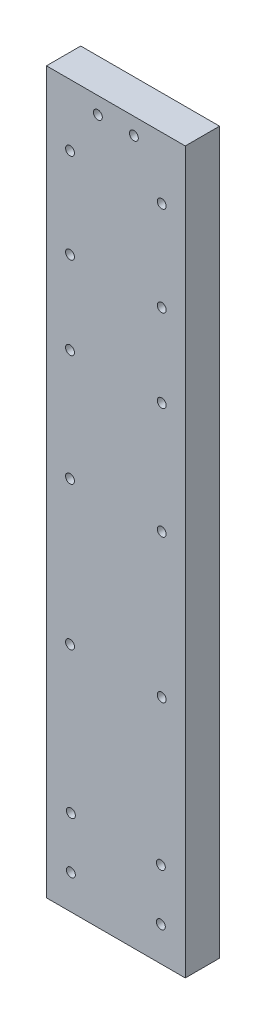
ISO-10303-21;
HEADER;
FILE_DESCRIPTION(('STEP AP214'),'2;1');
FILE_NAME('part.step','',(''),(''),'','','');
FILE_SCHEMA(('AUTOMOTIVE_DESIGN { 1 0 10303 214 1 1 1 1 }'));
ENDSEC;
DATA;
#1=APPLICATION_CONTEXT('core data for automotive mechanical design processes');
#2=APPLICATION_PROTOCOL_DEFINITION('international standard','automotive_design',2000,#1);
#3=PRODUCT_CONTEXT('',#1,'mechanical');
#4=PRODUCT('Part','Part','',(#3));
#5=PRODUCT_RELATED_PRODUCT_CATEGORY('part','',(#4));
#6=PRODUCT_DEFINITION_FORMATION('','',#4);
#7=PRODUCT_DEFINITION_CONTEXT('part definition',#1,'design');
#8=PRODUCT_DEFINITION('design','',#6,#7);
#9=PRODUCT_DEFINITION_SHAPE('','',#8);
#10=(LENGTH_UNIT() NAMED_UNIT(*) SI_UNIT(.MILLI.,.METRE.));
#11=(NAMED_UNIT(*) PLANE_ANGLE_UNIT() SI_UNIT($,.RADIAN.));
#12=(NAMED_UNIT(*) SI_UNIT($,.STERADIAN.) SOLID_ANGLE_UNIT());
#13=UNCERTAINTY_MEASURE_WITH_UNIT(LENGTH_MEASURE(1.E-05),#10,'distance_accuracy_value','');
#14=(GEOMETRIC_REPRESENTATION_CONTEXT(3) GLOBAL_UNCERTAINTY_ASSIGNED_CONTEXT((#13)) GLOBAL_UNIT_ASSIGNED_CONTEXT((#10,
#11,#12)) REPRESENTATION_CONTEXT('',''));
#15=CARTESIAN_POINT('',(0.,0.,0.));
#16=DIRECTION('',(0.,0.,1.));
#17=DIRECTION('',(1.,0.,0.));
#18=AXIS2_PLACEMENT_3D('',#15,#16,#17);
#19=CARTESIAN_POINT('',(0.,0.,4.));
#20=DIRECTION('',(0.,0.,-1.));
#21=DIRECTION('',(-1.,0.,0.));
#22=AXIS2_PLACEMENT_3D('',#19,#20,#21);
#23=PLANE('',#22);
#24=CARTESIAN_POINT('',(10.2,82.135,4.));
#25=DIRECTION('',(0.,0.,1.));
#26=DIRECTION('',(1.,0.,0.));
#27=AXIS2_PLACEMENT_3D('',#24,#25,#26);
#28=CIRCLE('',#27,0.519960121099865);
#29=CARTESIAN_POINT('',(10.7199601210999,82.135,4.));
#30=VERTEX_POINT('',#29);
#31=EDGE_CURVE('E193',#30,#30,#28,.T.);
#32=ORIENTED_EDGE('',*,*,#31,.F.);
#33=EDGE_LOOP('',(#32));
#34=FACE_BOUND('',#33,.T.);
#35=CARTESIAN_POINT('',(13.45,76.885,4.));
#36=DIRECTION('',(0.,0.,1.));
#37=DIRECTION('',(1.,0.,0.));
#38=AXIS2_PLACEMENT_3D('',#35,#36,#37);
#39=CIRCLE('',#38,0.519960121099861);
#40=CARTESIAN_POINT('',(13.9699601210999,76.885,4.));
#41=VERTEX_POINT('',#40);
#42=EDGE_CURVE('E181',#41,#41,#39,.T.);
#43=ORIENTED_EDGE('',*,*,#42,.F.);
#44=EDGE_LOOP('',(#43));
#45=FACE_BOUND('',#44,.T.);
#46=CARTESIAN_POINT('',(13.35,4.,4.));
#47=DIRECTION('',(0.,0.,1.));
#48=DIRECTION('',(-1.,0.,0.));
#49=AXIS2_PLACEMENT_3D('',#46,#47,#48);
#50=CIRCLE('',#49,0.519960121099866);
#51=CARTESIAN_POINT('',(12.8300398789001,4.,4.));
#52=VERTEX_POINT('',#51);
#53=EDGE_CURVE('E169',#52,#52,#50,.T.);
#54=ORIENTED_EDGE('',*,*,#53,.F.);
#55=EDGE_LOOP('',(#54));
#56=FACE_BOUND('',#55,.T.);
#57=CARTESIAN_POINT('',(2.85,4.,4.));
#58=DIRECTION('',(0.,0.,1.));
#59=DIRECTION('',(1.,0.,0.));
#60=AXIS2_PLACEMENT_3D('',#57,#58,#59);
#61=CIRCLE('',#60,0.519960121099866);
#62=CARTESIAN_POINT('',(3.36996012109987,4.,4.));
#63=VERTEX_POINT('',#62);
#64=EDGE_CURVE('E157',#63,#63,#61,.T.);
#65=ORIENTED_EDGE('',*,*,#64,.F.);
#66=EDGE_LOOP('',(#65));
#67=FACE_BOUND('',#66,.T.);
#68=CARTESIAN_POINT('',(13.45,66.385,4.));
#69=DIRECTION('',(0.,0.,1.));
#70=DIRECTION('',(1.,0.,0.));
#71=AXIS2_PLACEMENT_3D('',#68,#69,#70);
#72=CIRCLE('',#71,0.519960121099861);
#73=CARTESIAN_POINT('',(13.9699601210999,66.385,4.));
#74=VERTEX_POINT('',#73);
#75=EDGE_CURVE('E145',#74,#74,#72,.T.);
#76=ORIENTED_EDGE('',*,*,#75,.F.);
#77=EDGE_LOOP('',(#76));
#78=FACE_BOUND('',#77,.T.);
#79=CARTESIAN_POINT('',(13.45,56.74,4.));
#80=DIRECTION('',(0.,0.,1.));
#81=DIRECTION('',(1.,0.,0.));
#82=AXIS2_PLACEMENT_3D('',#79,#80,#81);
#83=CIRCLE('',#82,0.519960121099861);
#84=CARTESIAN_POINT('',(13.9699601210999,56.74,4.));
#85=VERTEX_POINT('',#84);
#86=EDGE_CURVE('E133',#85,#85,#83,.T.);
#87=ORIENTED_EDGE('',*,*,#86,.F.);
#88=EDGE_LOOP('',(#87));
#89=FACE_BOUND('',#88,.T.);
#90=CARTESIAN_POINT('',(13.45,43.74,4.));
#91=DIRECTION('',(0.,0.,1.));
#92=DIRECTION('',(1.,0.,0.));
#93=AXIS2_PLACEMENT_3D('',#90,#91,#92);
#94=CIRCLE('',#93,0.519960121099861);
#95=CARTESIAN_POINT('',(13.9699601210999,43.74,4.));
#96=VERTEX_POINT('',#95);
#97=EDGE_CURVE('E121',#96,#96,#94,.T.);
#98=ORIENTED_EDGE('',*,*,#97,.F.);
#99=EDGE_LOOP('',(#98));
#100=FACE_BOUND('',#99,.T.);
#101=CARTESIAN_POINT('',(13.45,27.,4.));
#102=DIRECTION('',(0.,0.,1.));
#103=DIRECTION('',(1.,0.,0.));
#104=AXIS2_PLACEMENT_3D('',#101,#102,#103);
#105=CIRCLE('',#104,0.519960121099865);
#106=CARTESIAN_POINT('',(13.9699601210999,27.,4.));
#107=VERTEX_POINT('',#106);
#108=EDGE_CURVE('E100',#107,#107,#105,.T.);
#109=ORIENTED_EDGE('',*,*,#108,.F.);
#110=EDGE_LOOP('',(#109));
#111=FACE_BOUND('',#110,.T.);
#112=DIRECTION('',(-1.,0.,0.));
#113=VECTOR('',#112,1.);
#114=CARTESIAN_POINT('',(16.2,84.09,4.));
#115=LINE('',#114,#113);
#116=CARTESIAN_POINT('',(16.2,84.09,4.));
#117=VERTEX_POINT('',#116);
#118=CARTESIAN_POINT('',(0.,84.09,4.));
#119=VERTEX_POINT('',#118);
#120=EDGE_CURVE('E85',#117,#119,#115,.T.);
#121=ORIENTED_EDGE('',*,*,#120,.T.);
#122=DIRECTION('',(0.,-1.,0.));
#123=VECTOR('',#122,1.);
#124=CARTESIAN_POINT('',(0.,0.,4.));
#125=LINE('',#124,#123);
#126=CARTESIAN_POINT('',(0.,0.,4.));
#127=VERTEX_POINT('',#126);
#128=EDGE_CURVE('E80',#119,#127,#125,.T.);
#129=ORIENTED_EDGE('',*,*,#128,.T.);
#130=DIRECTION('',(1.,0.,0.));
#131=VECTOR('',#130,1.);
#132=CARTESIAN_POINT('',(0.,0.,4.));
#133=LINE('',#132,#131);
#134=CARTESIAN_POINT('',(16.2,0.,4.));
#135=VERTEX_POINT('',#134);
#136=EDGE_CURVE('E83',#127,#135,#133,.T.);
#137=ORIENTED_EDGE('',*,*,#136,.T.);
#138=DIRECTION('',(0.,1.,0.));
#139=VECTOR('',#138,1.);
#140=CARTESIAN_POINT('',(16.2,0.,4.));
#141=LINE('',#140,#139);
#142=EDGE_CURVE('E50',#135,#117,#141,.T.);
#143=ORIENTED_EDGE('',*,*,#142,.T.);
#144=EDGE_LOOP('',(#121,#129,#137,#143));
#145=FACE_BOUND('',#144,.T.);
#146=CARTESIAN_POINT('',(2.75,27.,4.));
#147=DIRECTION('',(0.,0.,1.));
#148=DIRECTION('',(1.,0.,0.));
#149=AXIS2_PLACEMENT_3D('',#146,#147,#148);
#150=CIRCLE('',#149,0.519960121099867);
#151=CARTESIAN_POINT('',(3.26996012109987,27.,4.));
#152=VERTEX_POINT('',#151);
#153=EDGE_CURVE('E115',#152,#152,#150,.T.);
#154=ORIENTED_EDGE('',*,*,#153,.F.);
#155=EDGE_LOOP('',(#154));
#156=FACE_BOUND('',#155,.T.);
#157=CARTESIAN_POINT('',(2.75,43.74,4.));
#158=DIRECTION('',(0.,0.,1.));
#159=DIRECTION('',(1.,0.,0.));
#160=AXIS2_PLACEMENT_3D('',#157,#158,#159);
#161=CIRCLE('',#160,0.519960121099859);
#162=CARTESIAN_POINT('',(3.26996012109986,43.74,4.));
#163=VERTEX_POINT('',#162);
#164=EDGE_CURVE('E127',#163,#163,#161,.T.);
#165=ORIENTED_EDGE('',*,*,#164,.F.);
#166=EDGE_LOOP('',(#165));
#167=FACE_BOUND('',#166,.T.);
#168=CARTESIAN_POINT('',(2.75,56.74,4.));
#169=DIRECTION('',(0.,0.,1.));
#170=DIRECTION('',(1.,0.,0.));
#171=AXIS2_PLACEMENT_3D('',#168,#169,#170);
#172=CIRCLE('',#171,0.519960121099859);
#173=CARTESIAN_POINT('',(3.26996012109986,56.74,4.));
#174=VERTEX_POINT('',#173);
#175=EDGE_CURVE('E139',#174,#174,#172,.T.);
#176=ORIENTED_EDGE('',*,*,#175,.F.);
#177=EDGE_LOOP('',(#176));
#178=FACE_BOUND('',#177,.T.);
#179=CARTESIAN_POINT('',(2.85,10.,4.));
#180=DIRECTION('',(0.,0.,1.));
#181=DIRECTION('',(1.,0.,0.));
#182=AXIS2_PLACEMENT_3D('',#179,#180,#181);
#183=CIRCLE('',#182,0.519960121099866);
#184=CARTESIAN_POINT('',(3.36996012109986,10.,4.));
#185=VERTEX_POINT('',#184);
#186=EDGE_CURVE('E151',#185,#185,#183,.T.);
#187=ORIENTED_EDGE('',*,*,#186,.F.);
#188=EDGE_LOOP('',(#187));
#189=FACE_BOUND('',#188,.T.);
#190=CARTESIAN_POINT('',(13.3499999999999,10.,4.));
#191=DIRECTION('',(0.,0.,1.));
#192=DIRECTION('',(-1.,0.,0.));
#193=AXIS2_PLACEMENT_3D('',#190,#191,#192);
#194=CIRCLE('',#193,0.519960121099864);
#195=CARTESIAN_POINT('',(12.8300398789,10.,4.));
#196=VERTEX_POINT('',#195);
#197=EDGE_CURVE('E163',#196,#196,#194,.T.);
#198=ORIENTED_EDGE('',*,*,#197,.F.);
#199=EDGE_LOOP('',(#198));
#200=FACE_BOUND('',#199,.T.);
#201=CARTESIAN_POINT('',(2.74999999999862,66.385,4.));
#202=DIRECTION('',(0.,0.,1.));
#203=DIRECTION('',(1.,0.,0.));
#204=AXIS2_PLACEMENT_3D('',#201,#202,#203);
#205=CIRCLE('',#204,0.519960121099858);
#206=CARTESIAN_POINT('',(3.26996012109847,66.385,4.));
#207=VERTEX_POINT('',#206);
#208=EDGE_CURVE('E175',#207,#207,#205,.T.);
#209=ORIENTED_EDGE('',*,*,#208,.F.);
#210=EDGE_LOOP('',(#209));
#211=FACE_BOUND('',#210,.T.);
#212=CARTESIAN_POINT('',(2.74999999999862,76.885,4.));
#213=DIRECTION('',(0.,0.,1.));
#214=DIRECTION('',(1.,0.,0.));
#215=AXIS2_PLACEMENT_3D('',#212,#213,#214);
#216=CIRCLE('',#215,0.519960121099858);
#217=CARTESIAN_POINT('',(3.26996012109847,76.885,4.));
#218=VERTEX_POINT('',#217);
#219=EDGE_CURVE('E187',#218,#218,#216,.T.);
#220=ORIENTED_EDGE('',*,*,#219,.F.);
#221=EDGE_LOOP('',(#220));
#222=FACE_BOUND('',#221,.T.);
#223=CARTESIAN_POINT('',(6.,82.135,4.));
#224=DIRECTION('',(0.,0.,1.));
#225=DIRECTION('',(1.,0.,0.));
#226=AXIS2_PLACEMENT_3D('',#223,#224,#225);
#227=CIRCLE('',#226,0.519960121099861);
#228=CARTESIAN_POINT('',(6.51996012109986,82.135,4.));
#229=VERTEX_POINT('',#228);
#230=EDGE_CURVE('E199',#229,#229,#227,.T.);
#231=ORIENTED_EDGE('',*,*,#230,.F.);
#232=EDGE_LOOP('',(#231));
#233=FACE_BOUND('',#232,.T.);
#234=ADVANCED_FACE('F33',(#34,#45,#56,#67,#78,#89,#100,#111,#145,#156,#167,#178,#189,#200,#211,
#222,#233),#23,.F.);
#235=CARTESIAN_POINT('',(0.,0.,0.));
#236=DIRECTION('',(0.,0.,-1.));
#237=DIRECTION('',(-1.,0.,0.));
#238=AXIS2_PLACEMENT_3D('',#235,#236,#237);
#239=PLANE('',#238);
#240=CARTESIAN_POINT('',(10.2,82.135,0.));
#241=DIRECTION('',(0.,0.,1.));
#242=DIRECTION('',(1.,0.,0.));
#243=AXIS2_PLACEMENT_3D('',#240,#241,#242);
#244=CIRCLE('',#243,0.519960121099865);
#245=CARTESIAN_POINT('',(10.7199601210999,82.135,0.));
#246=VERTEX_POINT('',#245);
#247=EDGE_CURVE('E196',#246,#246,#244,.T.);
#248=ORIENTED_EDGE('',*,*,#247,.T.);
#249=EDGE_LOOP('',(#248));
#250=FACE_BOUND('',#249,.T.);
#251=CARTESIAN_POINT('',(13.45,76.885,0.));
#252=DIRECTION('',(0.,0.,1.));
#253=DIRECTION('',(1.,0.,0.));
#254=AXIS2_PLACEMENT_3D('',#251,#252,#253);
#255=CIRCLE('',#254,0.519960121099861);
#256=CARTESIAN_POINT('',(13.9699601210999,76.885,0.));
#257=VERTEX_POINT('',#256);
#258=EDGE_CURVE('E184',#257,#257,#255,.T.);
#259=ORIENTED_EDGE('',*,*,#258,.T.);
#260=EDGE_LOOP('',(#259));
#261=FACE_BOUND('',#260,.T.);
#262=CARTESIAN_POINT('',(13.35,4.,0.));
#263=DIRECTION('',(0.,0.,1.));
#264=DIRECTION('',(-1.,0.,0.));
#265=AXIS2_PLACEMENT_3D('',#262,#263,#264);
#266=CIRCLE('',#265,0.519960121099866);
#267=CARTESIAN_POINT('',(12.8300398789001,4.,0.));
#268=VERTEX_POINT('',#267);
#269=EDGE_CURVE('E172',#268,#268,#266,.T.);
#270=ORIENTED_EDGE('',*,*,#269,.T.);
#271=EDGE_LOOP('',(#270));
#272=FACE_BOUND('',#271,.T.);
#273=CARTESIAN_POINT('',(2.85,4.,0.));
#274=DIRECTION('',(0.,0.,1.));
#275=DIRECTION('',(1.,0.,0.));
#276=AXIS2_PLACEMENT_3D('',#273,#274,#275);
#277=CIRCLE('',#276,0.519960121099866);
#278=CARTESIAN_POINT('',(3.36996012109987,4.,0.));
#279=VERTEX_POINT('',#278);
#280=EDGE_CURVE('E160',#279,#279,#277,.T.);
#281=ORIENTED_EDGE('',*,*,#280,.T.);
#282=EDGE_LOOP('',(#281));
#283=FACE_BOUND('',#282,.T.);
#284=CARTESIAN_POINT('',(13.45,66.385,0.));
#285=DIRECTION('',(0.,0.,1.));
#286=DIRECTION('',(1.,0.,0.));
#287=AXIS2_PLACEMENT_3D('',#284,#285,#286);
#288=CIRCLE('',#287,0.519960121099861);
#289=CARTESIAN_POINT('',(13.9699601210999,66.385,0.));
#290=VERTEX_POINT('',#289);
#291=EDGE_CURVE('E148',#290,#290,#288,.T.);
#292=ORIENTED_EDGE('',*,*,#291,.T.);
#293=EDGE_LOOP('',(#292));
#294=FACE_BOUND('',#293,.T.);
#295=CARTESIAN_POINT('',(13.45,56.74,0.));
#296=DIRECTION('',(0.,0.,1.));
#297=DIRECTION('',(1.,0.,0.));
#298=AXIS2_PLACEMENT_3D('',#295,#296,#297);
#299=CIRCLE('',#298,0.519960121099861);
#300=CARTESIAN_POINT('',(13.9699601210999,56.74,0.));
#301=VERTEX_POINT('',#300);
#302=EDGE_CURVE('E136',#301,#301,#299,.T.);
#303=ORIENTED_EDGE('',*,*,#302,.T.);
#304=EDGE_LOOP('',(#303));
#305=FACE_BOUND('',#304,.T.);
#306=CARTESIAN_POINT('',(13.45,43.74,0.));
#307=DIRECTION('',(0.,0.,1.));
#308=DIRECTION('',(1.,0.,0.));
#309=AXIS2_PLACEMENT_3D('',#306,#307,#308);
#310=CIRCLE('',#309,0.519960121099861);
#311=CARTESIAN_POINT('',(13.9699601210999,43.74,0.));
#312=VERTEX_POINT('',#311);
#313=EDGE_CURVE('E124',#312,#312,#310,.T.);
#314=ORIENTED_EDGE('',*,*,#313,.T.);
#315=EDGE_LOOP('',(#314));
#316=FACE_BOUND('',#315,.T.);
#317=CARTESIAN_POINT('',(13.45,27.,0.));
#318=DIRECTION('',(0.,0.,1.));
#319=DIRECTION('',(1.,0.,0.));
#320=AXIS2_PLACEMENT_3D('',#317,#318,#319);
#321=CIRCLE('',#320,0.519960121099865);
#322=CARTESIAN_POINT('',(13.9699601210999,27.,0.));
#323=VERTEX_POINT('',#322);
#324=EDGE_CURVE('E112',#323,#323,#321,.T.);
#325=ORIENTED_EDGE('',*,*,#324,.T.);
#326=EDGE_LOOP('',(#325));
#327=FACE_BOUND('',#326,.T.);
#328=DIRECTION('',(-1.,0.,0.));
#329=VECTOR('',#328,1.);
#330=CARTESIAN_POINT('',(16.2,84.09,0.));
#331=LINE('',#330,#329);
#332=CARTESIAN_POINT('',(16.2,84.09,0.));
#333=VERTEX_POINT('',#332);
#334=CARTESIAN_POINT('',(0.,84.09,0.));
#335=VERTEX_POINT('',#334);
#336=EDGE_CURVE('E97',#333,#335,#331,.T.);
#337=ORIENTED_EDGE('',*,*,#336,.F.);
#338=DIRECTION('',(0.,1.,0.));
#339=VECTOR('',#338,1.);
#340=CARTESIAN_POINT('',(16.2,0.,0.));
#341=LINE('',#340,#339);
#342=CARTESIAN_POINT('',(16.2,0.,0.));
#343=VERTEX_POINT('',#342);
#344=EDGE_CURVE('E73',#343,#333,#341,.T.);
#345=ORIENTED_EDGE('',*,*,#344,.F.);
#346=DIRECTION('',(1.,0.,0.));
#347=VECTOR('',#346,1.);
#348=CARTESIAN_POINT('',(0.,0.,0.));
#349=LINE('',#348,#347);
#350=CARTESIAN_POINT('',(0.,0.,0.));
#351=VERTEX_POINT('',#350);
#352=EDGE_CURVE('E67',#351,#343,#349,.T.);
#353=ORIENTED_EDGE('',*,*,#352,.F.);
#354=DIRECTION('',(0.,-1.,0.));
#355=VECTOR('',#354,1.);
#356=CARTESIAN_POINT('',(0.,0.,0.));
#357=LINE('',#356,#355);
#358=EDGE_CURVE('E89',#335,#351,#357,.T.);
#359=ORIENTED_EDGE('',*,*,#358,.F.);
#360=EDGE_LOOP('',(#337,#345,#353,#359));
#361=FACE_BOUND('',#360,.T.);
#362=CARTESIAN_POINT('',(2.75,27.,0.));
#363=DIRECTION('',(0.,0.,1.));
#364=DIRECTION('',(1.,0.,0.));
#365=AXIS2_PLACEMENT_3D('',#362,#363,#364);
#366=CIRCLE('',#365,0.519960121099867);
#367=CARTESIAN_POINT('',(3.26996012109987,27.,0.));
#368=VERTEX_POINT('',#367);
#369=EDGE_CURVE('E118',#368,#368,#366,.T.);
#370=ORIENTED_EDGE('',*,*,#369,.T.);
#371=EDGE_LOOP('',(#370));
#372=FACE_BOUND('',#371,.T.);
#373=CARTESIAN_POINT('',(2.75,43.74,0.));
#374=DIRECTION('',(0.,0.,1.));
#375=DIRECTION('',(1.,0.,0.));
#376=AXIS2_PLACEMENT_3D('',#373,#374,#375);
#377=CIRCLE('',#376,0.519960121099859);
#378=CARTESIAN_POINT('',(3.26996012109986,43.74,0.));
#379=VERTEX_POINT('',#378);
#380=EDGE_CURVE('E130',#379,#379,#377,.T.);
#381=ORIENTED_EDGE('',*,*,#380,.T.);
#382=EDGE_LOOP('',(#381));
#383=FACE_BOUND('',#382,.T.);
#384=CARTESIAN_POINT('',(2.75,56.74,0.));
#385=DIRECTION('',(0.,0.,1.));
#386=DIRECTION('',(1.,0.,0.));
#387=AXIS2_PLACEMENT_3D('',#384,#385,#386);
#388=CIRCLE('',#387,0.519960121099859);
#389=CARTESIAN_POINT('',(3.26996012109986,56.74,0.));
#390=VERTEX_POINT('',#389);
#391=EDGE_CURVE('E142',#390,#390,#388,.T.);
#392=ORIENTED_EDGE('',*,*,#391,.T.);
#393=EDGE_LOOP('',(#392));
#394=FACE_BOUND('',#393,.T.);
#395=CARTESIAN_POINT('',(2.85,10.,0.));
#396=DIRECTION('',(0.,0.,1.));
#397=DIRECTION('',(1.,0.,0.));
#398=AXIS2_PLACEMENT_3D('',#395,#396,#397);
#399=CIRCLE('',#398,0.519960121099866);
#400=CARTESIAN_POINT('',(3.36996012109986,10.,0.));
#401=VERTEX_POINT('',#400);
#402=EDGE_CURVE('E154',#401,#401,#399,.T.);
#403=ORIENTED_EDGE('',*,*,#402,.T.);
#404=EDGE_LOOP('',(#403));
#405=FACE_BOUND('',#404,.T.);
#406=CARTESIAN_POINT('',(13.3499999999999,10.,0.));
#407=DIRECTION('',(0.,0.,1.));
#408=DIRECTION('',(-1.,0.,0.));
#409=AXIS2_PLACEMENT_3D('',#406,#407,#408);
#410=CIRCLE('',#409,0.519960121099864);
#411=CARTESIAN_POINT('',(12.8300398789,10.,0.));
#412=VERTEX_POINT('',#411);
#413=EDGE_CURVE('E166',#412,#412,#410,.T.);
#414=ORIENTED_EDGE('',*,*,#413,.T.);
#415=EDGE_LOOP('',(#414));
#416=FACE_BOUND('',#415,.T.);
#417=CARTESIAN_POINT('',(2.74999999999862,66.385,0.));
#418=DIRECTION('',(0.,0.,1.));
#419=DIRECTION('',(1.,0.,0.));
#420=AXIS2_PLACEMENT_3D('',#417,#418,#419);
#421=CIRCLE('',#420,0.519960121099858);
#422=CARTESIAN_POINT('',(3.26996012109847,66.385,0.));
#423=VERTEX_POINT('',#422);
#424=EDGE_CURVE('E178',#423,#423,#421,.T.);
#425=ORIENTED_EDGE('',*,*,#424,.T.);
#426=EDGE_LOOP('',(#425));
#427=FACE_BOUND('',#426,.T.);
#428=CARTESIAN_POINT('',(2.74999999999862,76.885,0.));
#429=DIRECTION('',(0.,0.,1.));
#430=DIRECTION('',(1.,0.,0.));
#431=AXIS2_PLACEMENT_3D('',#428,#429,#430);
#432=CIRCLE('',#431,0.519960121099858);
#433=CARTESIAN_POINT('',(3.26996012109847,76.885,0.));
#434=VERTEX_POINT('',#433);
#435=EDGE_CURVE('E190',#434,#434,#432,.T.);
#436=ORIENTED_EDGE('',*,*,#435,.T.);
#437=EDGE_LOOP('',(#436));
#438=FACE_BOUND('',#437,.T.);
#439=CARTESIAN_POINT('',(6.,82.135,0.));
#440=DIRECTION('',(0.,0.,1.));
#441=DIRECTION('',(1.,0.,0.));
#442=AXIS2_PLACEMENT_3D('',#439,#440,#441);
#443=CIRCLE('',#442,0.519960121099861);
#444=CARTESIAN_POINT('',(6.51996012109986,82.135,0.));
#445=VERTEX_POINT('',#444);
#446=EDGE_CURVE('E202',#445,#445,#443,.T.);
#447=ORIENTED_EDGE('',*,*,#446,.T.);
#448=EDGE_LOOP('',(#447));
#449=FACE_BOUND('',#448,.T.);
#450=ADVANCED_FACE('F108',(#250,#261,#272,#283,#294,#305,#316,#327,#361,#372,#383,#394,#405,
#416,#427,#438,#449),#239,.T.);
#451=CARTESIAN_POINT('',(16.2,84.09,4.));
#452=DIRECTION('',(0.,-1.,0.));
#453=DIRECTION('',(0.,0.,-1.));
#454=AXIS2_PLACEMENT_3D('',#451,#452,#453);
#455=PLANE('',#454);
#456=ORIENTED_EDGE('',*,*,#336,.T.);
#457=DIRECTION('',(0.,0.,-1.));
#458=VECTOR('',#457,1.);
#459=CARTESIAN_POINT('',(0.,84.09,4.));
#460=LINE('',#459,#458);
#461=EDGE_CURVE('E11',#119,#335,#460,.T.);
#462=ORIENTED_EDGE('',*,*,#461,.F.);
#463=ORIENTED_EDGE('',*,*,#120,.F.);
#464=DIRECTION('',(0.,0.,-1.));
#465=VECTOR('',#464,1.);
#466=CARTESIAN_POINT('',(16.2,84.09,4.));
#467=LINE('',#466,#465);
#468=EDGE_CURVE('E93',#117,#333,#467,.T.);
#469=ORIENTED_EDGE('',*,*,#468,.T.);
#470=EDGE_LOOP('',(#456,#462,#463,#469));
#471=FACE_BOUND('',#470,.T.);
#472=ADVANCED_FACE('F35',(#471),#455,.F.);
#473=CARTESIAN_POINT('',(0.,0.,4.));
#474=DIRECTION('',(1.,0.,0.));
#475=DIRECTION('',(0.,0.,-1.));
#476=AXIS2_PLACEMENT_3D('',#473,#474,#475);
#477=PLANE('',#476);
#478=ORIENTED_EDGE('',*,*,#358,.T.);
#479=DIRECTION('',(0.,0.,-1.));
#480=VECTOR('',#479,1.);
#481=CARTESIAN_POINT('',(0.,0.,4.));
#482=LINE('',#481,#480);
#483=EDGE_CURVE('E42',#127,#351,#482,.T.);
#484=ORIENTED_EDGE('',*,*,#483,.F.);
#485=ORIENTED_EDGE('',*,*,#128,.F.);
#486=ORIENTED_EDGE('',*,*,#461,.T.);
#487=EDGE_LOOP('',(#478,#484,#485,#486));
#488=FACE_BOUND('',#487,.T.);
#489=ADVANCED_FACE('F88',(#488),#477,.F.);
#490=CARTESIAN_POINT('',(0.,0.,4.));
#491=DIRECTION('',(0.,1.,0.));
#492=DIRECTION('',(0.,0.,1.));
#493=AXIS2_PLACEMENT_3D('',#490,#491,#492);
#494=PLANE('',#493);
#495=ORIENTED_EDGE('',*,*,#352,.T.);
#496=DIRECTION('',(0.,0.,-1.));
#497=VECTOR('',#496,1.);
#498=CARTESIAN_POINT('',(16.2,0.,4.));
#499=LINE('',#498,#497);
#500=EDGE_CURVE('E90',#135,#343,#499,.T.);
#501=ORIENTED_EDGE('',*,*,#500,.F.);
#502=ORIENTED_EDGE('',*,*,#136,.F.);
#503=ORIENTED_EDGE('',*,*,#483,.T.);
#504=EDGE_LOOP('',(#495,#501,#502,#503));
#505=FACE_BOUND('',#504,.T.);
#506=ADVANCED_FACE('F91',(#505),#494,.F.);
#507=CARTESIAN_POINT('',(16.2,0.,4.));
#508=DIRECTION('',(-1.,0.,0.));
#509=DIRECTION('',(0.,0.,1.));
#510=AXIS2_PLACEMENT_3D('',#507,#508,#509);
#511=PLANE('',#510);
#512=ORIENTED_EDGE('',*,*,#344,.T.);
#513=ORIENTED_EDGE('',*,*,#468,.F.);
#514=ORIENTED_EDGE('',*,*,#142,.F.);
#515=ORIENTED_EDGE('',*,*,#500,.T.);
#516=EDGE_LOOP('',(#512,#513,#514,#515));
#517=FACE_BOUND('',#516,.T.);
#518=ADVANCED_FACE('F105',(#517),#511,.F.);
#519=CARTESIAN_POINT('',(13.45,27.,4.));
#520=DIRECTION('',(0.,0.,-1.));
#521=DIRECTION('',(-1.,0.,0.));
#522=AXIS2_PLACEMENT_3D('',#519,#520,#521);
#523=CYLINDRICAL_SURFACE('',#522,0.519960121099865);
#524=ORIENTED_EDGE('',*,*,#108,.T.);
#525=EDGE_LOOP('',(#524));
#526=FACE_BOUND('',#525,.T.);
#527=ORIENTED_EDGE('',*,*,#324,.F.);
#528=EDGE_LOOP('',(#527));
#529=FACE_BOUND('',#528,.T.);
#530=ADVANCED_FACE('F222',(#526,#529),#523,.F.);
#531=CARTESIAN_POINT('',(2.75,27.,4.));
#532=DIRECTION('',(0.,0.,-1.));
#533=DIRECTION('',(-1.,0.,0.));
#534=AXIS2_PLACEMENT_3D('',#531,#532,#533);
#535=CYLINDRICAL_SURFACE('',#534,0.519960121099867);
#536=ORIENTED_EDGE('',*,*,#153,.T.);
#537=EDGE_LOOP('',(#536));
#538=FACE_BOUND('',#537,.T.);
#539=ORIENTED_EDGE('',*,*,#369,.F.);
#540=EDGE_LOOP('',(#539));
#541=FACE_BOUND('',#540,.T.);
#542=ADVANCED_FACE('F268',(#538,#541),#535,.F.);
#543=CARTESIAN_POINT('',(13.45,43.74,4.));
#544=DIRECTION('',(0.,0.,-1.));
#545=DIRECTION('',(-1.,0.,0.));
#546=AXIS2_PLACEMENT_3D('',#543,#544,#545);
#547=CYLINDRICAL_SURFACE('',#546,0.519960121099861);
#548=ORIENTED_EDGE('',*,*,#97,.T.);
#549=EDGE_LOOP('',(#548));
#550=FACE_BOUND('',#549,.T.);
#551=ORIENTED_EDGE('',*,*,#313,.F.);
#552=EDGE_LOOP('',(#551));
#553=FACE_BOUND('',#552,.T.);
#554=ADVANCED_FACE('F276',(#550,#553),#547,.F.);
#555=CARTESIAN_POINT('',(2.75,43.74,4.));
#556=DIRECTION('',(0.,0.,-1.));
#557=DIRECTION('',(-1.,0.,0.));
#558=AXIS2_PLACEMENT_3D('',#555,#556,#557);
#559=CYLINDRICAL_SURFACE('',#558,0.519960121099859);
#560=ORIENTED_EDGE('',*,*,#164,.T.);
#561=EDGE_LOOP('',(#560));
#562=FACE_BOUND('',#561,.T.);
#563=ORIENTED_EDGE('',*,*,#380,.F.);
#564=EDGE_LOOP('',(#563));
#565=FACE_BOUND('',#564,.T.);
#566=ADVANCED_FACE('F284',(#562,#565),#559,.F.);
#567=CARTESIAN_POINT('',(13.45,56.74,4.));
#568=DIRECTION('',(0.,0.,-1.));
#569=DIRECTION('',(-1.,0.,0.));
#570=AXIS2_PLACEMENT_3D('',#567,#568,#569);
#571=CYLINDRICAL_SURFACE('',#570,0.519960121099861);
#572=ORIENTED_EDGE('',*,*,#86,.T.);
#573=EDGE_LOOP('',(#572));
#574=FACE_BOUND('',#573,.T.);
#575=ORIENTED_EDGE('',*,*,#302,.F.);
#576=EDGE_LOOP('',(#575));
#577=FACE_BOUND('',#576,.T.);
#578=ADVANCED_FACE('F293',(#574,#577),#571,.F.);
#579=CARTESIAN_POINT('',(2.75,56.74,4.));
#580=DIRECTION('',(0.,0.,-1.));
#581=DIRECTION('',(-1.,0.,0.));
#582=AXIS2_PLACEMENT_3D('',#579,#580,#581);
#583=CYLINDRICAL_SURFACE('',#582,0.519960121099859);
#584=ORIENTED_EDGE('',*,*,#175,.T.);
#585=EDGE_LOOP('',(#584));
#586=FACE_BOUND('',#585,.T.);
#587=ORIENTED_EDGE('',*,*,#391,.F.);
#588=EDGE_LOOP('',(#587));
#589=FACE_BOUND('',#588,.T.);
#590=ADVANCED_FACE('F302',(#586,#589),#583,.F.);
#591=CARTESIAN_POINT('',(13.45,66.385,4.));
#592=DIRECTION('',(0.,0.,-1.));
#593=DIRECTION('',(-1.,0.,0.));
#594=AXIS2_PLACEMENT_3D('',#591,#592,#593);
#595=CYLINDRICAL_SURFACE('',#594,0.519960121099861);
#596=ORIENTED_EDGE('',*,*,#75,.T.);
#597=EDGE_LOOP('',(#596));
#598=FACE_BOUND('',#597,.T.);
#599=ORIENTED_EDGE('',*,*,#291,.F.);
#600=EDGE_LOOP('',(#599));
#601=FACE_BOUND('',#600,.T.);
#602=ADVANCED_FACE('F311',(#598,#601),#595,.F.);
#603=CARTESIAN_POINT('',(2.85,10.,4.));
#604=DIRECTION('',(0.,0.,-1.));
#605=DIRECTION('',(-1.,0.,0.));
#606=AXIS2_PLACEMENT_3D('',#603,#604,#605);
#607=CYLINDRICAL_SURFACE('',#606,0.519960121099866);
#608=ORIENTED_EDGE('',*,*,#186,.T.);
#609=EDGE_LOOP('',(#608));
#610=FACE_BOUND('',#609,.T.);
#611=ORIENTED_EDGE('',*,*,#402,.F.);
#612=EDGE_LOOP('',(#611));
#613=FACE_BOUND('',#612,.T.);
#614=ADVANCED_FACE('F320',(#610,#613),#607,.F.);
#615=CARTESIAN_POINT('',(2.85,4.,4.));
#616=DIRECTION('',(0.,0.,-1.));
#617=DIRECTION('',(-1.,0.,0.));
#618=AXIS2_PLACEMENT_3D('',#615,#616,#617);
#619=CYLINDRICAL_SURFACE('',#618,0.519960121099866);
#620=ORIENTED_EDGE('',*,*,#64,.T.);
#621=EDGE_LOOP('',(#620));
#622=FACE_BOUND('',#621,.T.);
#623=ORIENTED_EDGE('',*,*,#280,.F.);
#624=EDGE_LOOP('',(#623));
#625=FACE_BOUND('',#624,.T.);
#626=ADVANCED_FACE('F329',(#622,#625),#619,.F.);
#627=CARTESIAN_POINT('',(13.3499999999999,10.,4.));
#628=DIRECTION('',(0.,0.,-1.));
#629=DIRECTION('',(-1.,0.,0.));
#630=AXIS2_PLACEMENT_3D('',#627,#628,#629);
#631=CYLINDRICAL_SURFACE('',#630,0.519960121099864);
#632=ORIENTED_EDGE('',*,*,#197,.T.);
#633=EDGE_LOOP('',(#632));
#634=FACE_BOUND('',#633,.T.);
#635=ORIENTED_EDGE('',*,*,#413,.F.);
#636=EDGE_LOOP('',(#635));
#637=FACE_BOUND('',#636,.T.);
#638=ADVANCED_FACE('F338',(#634,#637),#631,.F.);
#639=CARTESIAN_POINT('',(13.35,4.,4.));
#640=DIRECTION('',(0.,0.,-1.));
#641=DIRECTION('',(-1.,0.,0.));
#642=AXIS2_PLACEMENT_3D('',#639,#640,#641);
#643=CYLINDRICAL_SURFACE('',#642,0.519960121099866);
#644=ORIENTED_EDGE('',*,*,#53,.T.);
#645=EDGE_LOOP('',(#644));
#646=FACE_BOUND('',#645,.T.);
#647=ORIENTED_EDGE('',*,*,#269,.F.);
#648=EDGE_LOOP('',(#647));
#649=FACE_BOUND('',#648,.T.);
#650=ADVANCED_FACE('F347',(#646,#649),#643,.F.);
#651=CARTESIAN_POINT('',(2.74999999999862,66.385,4.));
#652=DIRECTION('',(0.,0.,-1.));
#653=DIRECTION('',(-1.,0.,0.));
#654=AXIS2_PLACEMENT_3D('',#651,#652,#653);
#655=CYLINDRICAL_SURFACE('',#654,0.519960121099858);
#656=ORIENTED_EDGE('',*,*,#208,.T.);
#657=EDGE_LOOP('',(#656));
#658=FACE_BOUND('',#657,.T.);
#659=ORIENTED_EDGE('',*,*,#424,.F.);
#660=EDGE_LOOP('',(#659));
#661=FACE_BOUND('',#660,.T.);
#662=ADVANCED_FACE('F356',(#658,#661),#655,.F.);
#663=CARTESIAN_POINT('',(13.45,76.885,4.));
#664=DIRECTION('',(0.,0.,-1.));
#665=DIRECTION('',(-1.,0.,0.));
#666=AXIS2_PLACEMENT_3D('',#663,#664,#665);
#667=CYLINDRICAL_SURFACE('',#666,0.519960121099861);
#668=ORIENTED_EDGE('',*,*,#42,.T.);
#669=EDGE_LOOP('',(#668));
#670=FACE_BOUND('',#669,.T.);
#671=ORIENTED_EDGE('',*,*,#258,.F.);
#672=EDGE_LOOP('',(#671));
#673=FACE_BOUND('',#672,.T.);
#674=ADVANCED_FACE('F365',(#670,#673),#667,.F.);
#675=CARTESIAN_POINT('',(2.74999999999862,76.885,4.));
#676=DIRECTION('',(0.,0.,-1.));
#677=DIRECTION('',(-1.,0.,0.));
#678=AXIS2_PLACEMENT_3D('',#675,#676,#677);
#679=CYLINDRICAL_SURFACE('',#678,0.519960121099858);
#680=ORIENTED_EDGE('',*,*,#219,.T.);
#681=EDGE_LOOP('',(#680));
#682=FACE_BOUND('',#681,.T.);
#683=ORIENTED_EDGE('',*,*,#435,.F.);
#684=EDGE_LOOP('',(#683));
#685=FACE_BOUND('',#684,.T.);
#686=ADVANCED_FACE('F374',(#682,#685),#679,.F.);
#687=CARTESIAN_POINT('',(10.2,82.135,4.));
#688=DIRECTION('',(0.,0.,-1.));
#689=DIRECTION('',(-1.,0.,0.));
#690=AXIS2_PLACEMENT_3D('',#687,#688,#689);
#691=CYLINDRICAL_SURFACE('',#690,0.519960121099865);
#692=ORIENTED_EDGE('',*,*,#31,.T.);
#693=EDGE_LOOP('',(#692));
#694=FACE_BOUND('',#693,.T.);
#695=ORIENTED_EDGE('',*,*,#247,.F.);
#696=EDGE_LOOP('',(#695));
#697=FACE_BOUND('',#696,.T.);
#698=ADVANCED_FACE('F383',(#694,#697),#691,.F.);
#699=CARTESIAN_POINT('',(6.,82.135,4.));
#700=DIRECTION('',(0.,0.,-1.));
#701=DIRECTION('',(-1.,0.,0.));
#702=AXIS2_PLACEMENT_3D('',#699,#700,#701);
#703=CYLINDRICAL_SURFACE('',#702,0.519960121099861);
#704=ORIENTED_EDGE('',*,*,#230,.T.);
#705=EDGE_LOOP('',(#704));
#706=FACE_BOUND('',#705,.T.);
#707=ORIENTED_EDGE('',*,*,#446,.F.);
#708=EDGE_LOOP('',(#707));
#709=FACE_BOUND('',#708,.T.);
#710=ADVANCED_FACE('F208',(#706,#709),#703,.F.);
#711=CLOSED_SHELL('',(#234,#450,#472,#489,#506,#518,#530,#542,#554,#566,#578,#590,#602,#614,
#626,#638,#650,#662,#674,#686,#698,#710));
#712=MANIFOLD_SOLID_BREP('B2',#711);
#713=ADVANCED_BREP_SHAPE_REPRESENTATION('',(#18,#712),#14);
#714=SHAPE_DEFINITION_REPRESENTATION(#9,#713);
ENDSEC;
END-ISO-10303-21;
